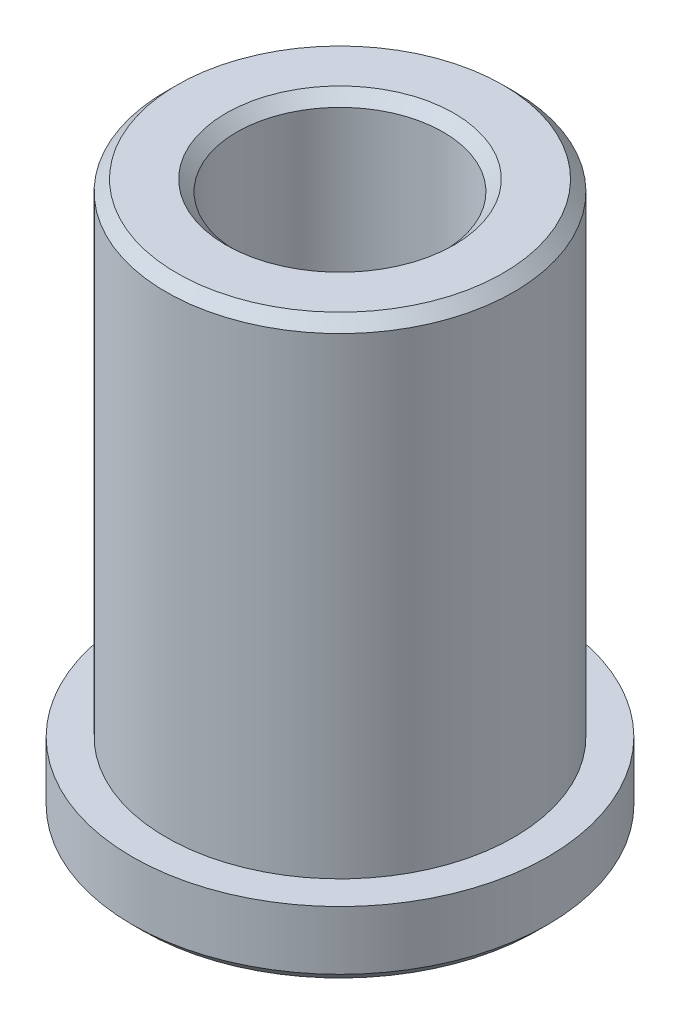
ISO-10303-21;
HEADER;
FILE_DESCRIPTION(('STEP AP214'),'2;1');
FILE_NAME('part.step','',(''),(''),'','','');
FILE_SCHEMA(('AUTOMOTIVE_DESIGN { 1 0 10303 214 1 1 1 1 }'));
ENDSEC;
DATA;
#1=APPLICATION_CONTEXT('core data for automotive mechanical design processes');
#2=APPLICATION_PROTOCOL_DEFINITION('international standard','automotive_design',2000,#1);
#3=PRODUCT_CONTEXT('',#1,'mechanical');
#4=PRODUCT('Part','Part','',(#3));
#5=PRODUCT_RELATED_PRODUCT_CATEGORY('part','',(#4));
#6=PRODUCT_DEFINITION_FORMATION('','',#4);
#7=PRODUCT_DEFINITION_CONTEXT('part definition',#1,'design');
#8=PRODUCT_DEFINITION('design','',#6,#7);
#9=PRODUCT_DEFINITION_SHAPE('','',#8);
#10=(LENGTH_UNIT() NAMED_UNIT(*) SI_UNIT(.MILLI.,.METRE.));
#11=(NAMED_UNIT(*) PLANE_ANGLE_UNIT() SI_UNIT($,.RADIAN.));
#12=(NAMED_UNIT(*) SI_UNIT($,.STERADIAN.) SOLID_ANGLE_UNIT());
#13=UNCERTAINTY_MEASURE_WITH_UNIT(LENGTH_MEASURE(1.E-05),#10,'distance_accuracy_value','');
#14=(GEOMETRIC_REPRESENTATION_CONTEXT(3) GLOBAL_UNCERTAINTY_ASSIGNED_CONTEXT((#13)) GLOBAL_UNIT_ASSIGNED_CONTEXT((#10,
#11,#12)) REPRESENTATION_CONTEXT('',''));
#15=CARTESIAN_POINT('',(0.,0.,0.));
#16=DIRECTION('',(0.,0.,1.));
#17=DIRECTION('',(1.,0.,0.));
#18=AXIS2_PLACEMENT_3D('',#15,#16,#17);
#19=CARTESIAN_POINT('',(0.,0.,0.));
#20=DIRECTION('',(0.,-1.,0.));
#21=DIRECTION('',(0.,0.,-1.));
#22=AXIS2_PLACEMENT_3D('',#19,#20,#21);
#23=CONICAL_SURFACE('',#22,2.62499999996635,0.785398163511135);
#24=CARTESIAN_POINT('',(0.,0.250000000000002,0.));
#25=DIRECTION('',(0.,-1.,0.));
#26=DIRECTION('',(0.,0.,-1.));
#27=AXIS2_PLACEMENT_3D('',#24,#25,#26);
#28=CIRCLE('',#27,2.375);
#29=CARTESIAN_POINT('',(0.,0.250000000000002,-2.375));
#30=VERTEX_POINT('',#29);
#31=EDGE_CURVE('E36',#30,#30,#28,.F.);
#32=ORIENTED_EDGE('',*,*,#31,.T.);
#33=EDGE_LOOP('',(#32));
#34=FACE_BOUND('',#33,.T.);
#35=CARTESIAN_POINT('',(0.,0.,0.));
#36=DIRECTION('',(0.,-1.,0.));
#37=DIRECTION('',(0.,0.,-1.));
#38=AXIS2_PLACEMENT_3D('',#35,#36,#37);
#39=CIRCLE('',#38,2.62499999996635);
#40=CARTESIAN_POINT('',(0.,0.,-2.62499999996635));
#41=VERTEX_POINT('',#40);
#42=EDGE_CURVE('E16',#41,#41,#39,.T.);
#43=ORIENTED_EDGE('',*,*,#42,.T.);
#44=EDGE_LOOP('',(#43));
#45=FACE_BOUND('',#44,.T.);
#46=ADVANCED_FACE('F13',(#34,#45),#23,.F.);
#47=CARTESIAN_POINT('',(-4.78,0.,0.));
#48=DIRECTION('',(0.,1.,0.));
#49=DIRECTION('',(0.,0.,1.));
#50=AXIS2_PLACEMENT_3D('',#47,#48,#49);
#51=PLANE('',#50);
#52=ORIENTED_EDGE('',*,*,#42,.F.);
#53=EDGE_LOOP('',(#52));
#54=FACE_BOUND('',#53,.T.);
#55=CARTESIAN_POINT('',(0.,5.6843418860808E-11,0.));
#56=DIRECTION('',(0.,1.,0.));
#57=DIRECTION('',(0.,0.,1.));
#58=AXIS2_PLACEMENT_3D('',#55,#56,#57);
#59=CIRCLE('',#58,4.52999999998838);
#60=CARTESIAN_POINT('',(0.,5.6843418860808E-11,4.52999999998838));
#61=VERTEX_POINT('',#60);
#62=EDGE_CURVE('E35',#61,#61,#59,.T.);
#63=ORIENTED_EDGE('',*,*,#62,.F.);
#64=EDGE_LOOP('',(#63));
#65=FACE_BOUND('',#64,.T.);
#66=ADVANCED_FACE('F51',(#54,#65),#51,.F.);
#67=CARTESIAN_POINT('',(0.,0.,0.));
#68=DIRECTION('',(0.,-1.,0.));
#69=DIRECTION('',(0.,0.,-1.));
#70=AXIS2_PLACEMENT_3D('',#67,#68,#69);
#71=CYLINDRICAL_SURFACE('',#70,2.375);
#72=CARTESIAN_POINT('',(0.,12.4624999999696,0.));
#73=DIRECTION('',(0.,1.,0.));
#74=DIRECTION('',(0.,0.,1.));
#75=AXIS2_PLACEMENT_3D('',#72,#73,#74);
#76=CIRCLE('',#75,2.37499999997226);
#77=CARTESIAN_POINT('',(0.,12.4624999999696,2.37499999997226));
#78=VERTEX_POINT('',#77);
#79=EDGE_CURVE('E32',#78,#78,#76,.T.);
#80=ORIENTED_EDGE('',*,*,#79,.T.);
#81=EDGE_LOOP('',(#80));
#82=FACE_BOUND('',#81,.T.);
#83=ORIENTED_EDGE('',*,*,#31,.F.);
#84=EDGE_LOOP('',(#83));
#85=FACE_BOUND('',#84,.T.);
#86=ADVANCED_FACE('F53',(#82,#85),#71,.F.);
#87=CARTESIAN_POINT('',(0.,0.250000000107775,0.));
#88=DIRECTION('',(0.,1.,0.));
#89=DIRECTION('',(0.,0.,1.));
#90=AXIS2_PLACEMENT_3D('',#87,#88,#89);
#91=CONICAL_SURFACE('',#90,4.78000000009615,0.785398163511135);
#92=ORIENTED_EDGE('',*,*,#62,.T.);
#93=EDGE_LOOP('',(#92));
#94=FACE_BOUND('',#93,.T.);
#95=CARTESIAN_POINT('',(0.,0.249999999999999,0.));
#96=DIRECTION('',(0.,-1.,0.));
#97=DIRECTION('',(0.,0.,-1.));
#98=AXIS2_PLACEMENT_3D('',#95,#96,#97);
#99=CIRCLE('',#98,4.78);
#100=CARTESIAN_POINT('',(0.,0.249999999999999,-4.78));
#101=VERTEX_POINT('',#100);
#102=EDGE_CURVE('E28',#101,#101,#99,.F.);
#103=ORIENTED_EDGE('',*,*,#102,.F.);
#104=EDGE_LOOP('',(#103));
#105=FACE_BOUND('',#104,.T.);
#106=ADVANCED_FACE('F48',(#94,#105),#91,.T.);
#107=CARTESIAN_POINT('',(0.,12.7124999999069,0.));
#108=DIRECTION('',(0.,1.,0.));
#109=DIRECTION('',(-1.,0.,0.));
#110=AXIS2_PLACEMENT_3D('',#107,#108,#109);
#111=CONICAL_SURFACE('',#110,2.62499999990951,0.785398163397448);
#112=CARTESIAN_POINT('',(0.,12.7124999999637,0.));
#113=DIRECTION('',(0.,1.,0.));
#114=DIRECTION('',(-1.,0.,0.));
#115=AXIS2_PLACEMENT_3D('',#112,#113,#114);
#116=CIRCLE('',#115,2.62499999996635);
#117=CARTESIAN_POINT('',(-2.62499999996635,12.7124999999637,0.));
#118=VERTEX_POINT('',#117);
#119=EDGE_CURVE('E31',#118,#118,#116,.T.);
#120=ORIENTED_EDGE('',*,*,#119,.T.);
#121=EDGE_LOOP('',(#120));
#122=FACE_BOUND('',#121,.T.);
#123=ORIENTED_EDGE('',*,*,#79,.F.);
#124=EDGE_LOOP('',(#123));
#125=FACE_BOUND('',#124,.T.);
#126=ADVANCED_FACE('F86',(#122,#125),#111,.F.);
#127=CARTESIAN_POINT('',(0.,0.,0.));
#128=DIRECTION('',(0.,-1.,0.));
#129=DIRECTION('',(0.,0.,-1.));
#130=AXIS2_PLACEMENT_3D('',#127,#128,#129);
#131=CYLINDRICAL_SURFACE('',#130,4.78);
#132=CARTESIAN_POINT('',(0.,1.6,0.));
#133=DIRECTION('',(0.,-1.,0.));
#134=DIRECTION('',(0.,0.,-1.));
#135=AXIS2_PLACEMENT_3D('',#132,#133,#134);
#136=CIRCLE('',#135,4.78);
#137=CARTESIAN_POINT('',(0.,1.6,-4.78));
#138=VERTEX_POINT('',#137);
#139=EDGE_CURVE('E41',#138,#138,#136,.T.);
#140=ORIENTED_EDGE('',*,*,#139,.T.);
#141=EDGE_LOOP('',(#140));
#142=FACE_BOUND('',#141,.T.);
#143=ORIENTED_EDGE('',*,*,#102,.T.);
#144=EDGE_LOOP('',(#143));
#145=FACE_BOUND('',#144,.T.);
#146=ADVANCED_FACE('F82',(#142,#145),#131,.T.);
#147=CARTESIAN_POINT('',(-2.375,12.7125,0.));
#148=DIRECTION('',(0.,-1.,0.));
#149=DIRECTION('',(0.,0.,-1.));
#150=AXIS2_PLACEMENT_3D('',#147,#148,#149);
#151=PLANE('',#150);
#152=ORIENTED_EDGE('',*,*,#119,.F.);
#153=EDGE_LOOP('',(#152));
#154=FACE_BOUND('',#153,.T.);
#155=CARTESIAN_POINT('',(0.,12.7124999999637,0.));
#156=DIRECTION('',(0.,-1.,0.));
#157=DIRECTION('',(0.,0.,-1.));
#158=AXIS2_PLACEMENT_3D('',#155,#156,#157);
#159=CIRCLE('',#158,3.75000000002501);
#160=CARTESIAN_POINT('',(0.,12.7124999999637,-3.75000000002501));
#161=VERTEX_POINT('',#160);
#162=EDGE_CURVE('E25',#161,#161,#159,.T.);
#163=ORIENTED_EDGE('',*,*,#162,.F.);
#164=EDGE_LOOP('',(#163));
#165=FACE_BOUND('',#164,.T.);
#166=ADVANCED_FACE('F78',(#154,#165),#151,.F.);
#167=CARTESIAN_POINT('',(-4.,1.6,0.));
#168=DIRECTION('',(0.,-1.,0.));
#169=DIRECTION('',(0.,0.,-1.));
#170=AXIS2_PLACEMENT_3D('',#167,#168,#169);
#171=PLANE('',#170);
#172=CARTESIAN_POINT('',(0.,1.6,0.));
#173=DIRECTION('',(0.,-1.,0.));
#174=DIRECTION('',(0.,0.,-1.));
#175=AXIS2_PLACEMENT_3D('',#172,#173,#174);
#176=CIRCLE('',#175,4.);
#177=CARTESIAN_POINT('',(0.,1.6,-4.));
#178=VERTEX_POINT('',#177);
#179=EDGE_CURVE('E20',#178,#178,#176,.F.);
#180=ORIENTED_EDGE('',*,*,#179,.F.);
#181=EDGE_LOOP('',(#180));
#182=FACE_BOUND('',#181,.T.);
#183=ORIENTED_EDGE('',*,*,#139,.F.);
#184=EDGE_LOOP('',(#183));
#185=FACE_BOUND('',#184,.T.);
#186=ADVANCED_FACE('F72',(#182,#185),#171,.F.);
#187=CARTESIAN_POINT('',(0.,12.4624999999696,0.));
#188=DIRECTION('',(0.,-1.,0.));
#189=DIRECTION('',(0.,0.,-1.));
#190=AXIS2_PLACEMENT_3D('',#187,#188,#189);
#191=CONICAL_SURFACE('',#190,4.0000000000191,0.785398163397448);
#192=CARTESIAN_POINT('',(0.,12.4625,0.));
#193=DIRECTION('',(0.,-1.,0.));
#194=DIRECTION('',(0.,0.,-1.));
#195=AXIS2_PLACEMENT_3D('',#192,#193,#194);
#196=CIRCLE('',#195,4.);
#197=CARTESIAN_POINT('',(0.,12.4625,-4.));
#198=VERTEX_POINT('',#197);
#199=EDGE_CURVE('E9',#198,#198,#196,.T.);
#200=ORIENTED_EDGE('',*,*,#199,.F.);
#201=EDGE_LOOP('',(#200));
#202=FACE_BOUND('',#201,.T.);
#203=ORIENTED_EDGE('',*,*,#162,.T.);
#204=EDGE_LOOP('',(#203));
#205=FACE_BOUND('',#204,.T.);
#206=ADVANCED_FACE('F66',(#202,#205),#191,.T.);
#207=CARTESIAN_POINT('',(0.,0.,0.));
#208=DIRECTION('',(0.,-1.,0.));
#209=DIRECTION('',(0.,0.,-1.));
#210=AXIS2_PLACEMENT_3D('',#207,#208,#209);
#211=CYLINDRICAL_SURFACE('',#210,4.);
#212=ORIENTED_EDGE('',*,*,#179,.T.);
#213=EDGE_LOOP('',(#212));
#214=FACE_BOUND('',#213,.T.);
#215=ORIENTED_EDGE('',*,*,#199,.T.);
#216=EDGE_LOOP('',(#215));
#217=FACE_BOUND('',#216,.T.);
#218=ADVANCED_FACE('F64',(#214,#217),#211,.T.);
#219=CLOSED_SHELL('',(#46,#66,#86,#106,#126,#146,#166,#186,#206,#218));
#220=MANIFOLD_SOLID_BREP('B1',#219);
#221=ADVANCED_BREP_SHAPE_REPRESENTATION('',(#18,#220),#14);
#222=SHAPE_DEFINITION_REPRESENTATION(#9,#221);
ENDSEC;
END-ISO-10303-21;
